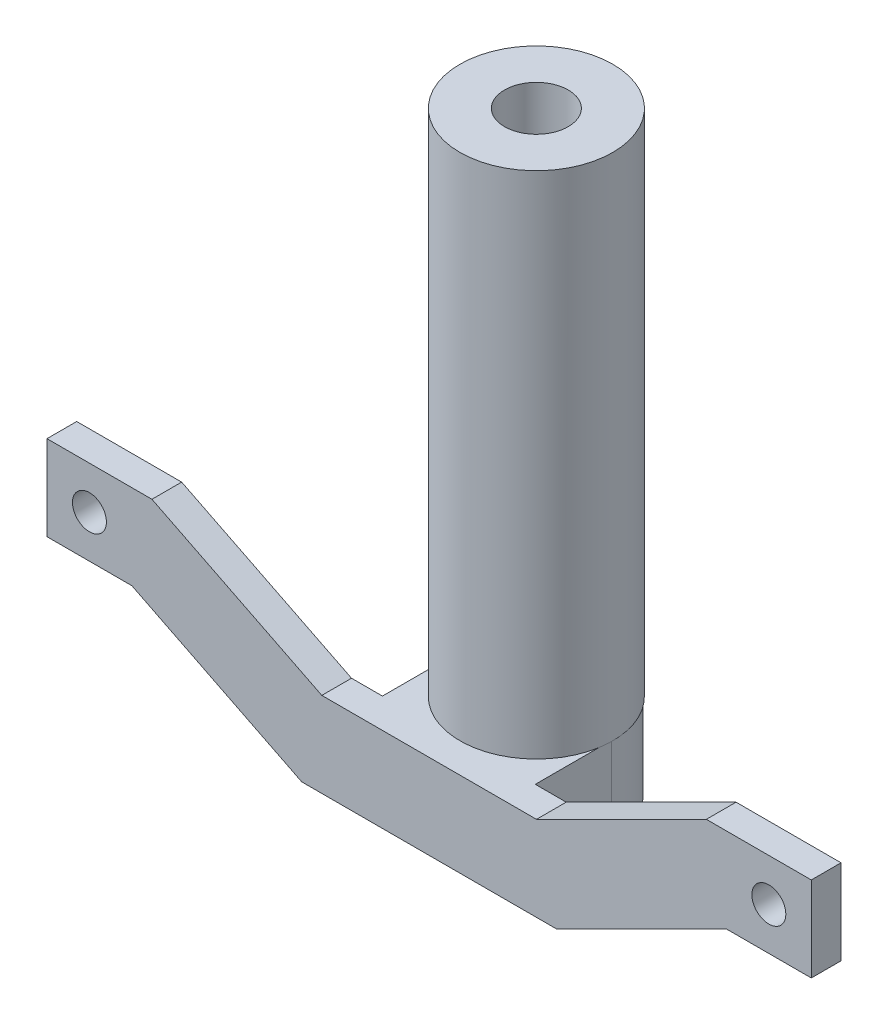
ISO-10303-21;
HEADER;
FILE_DESCRIPTION(('STEP AP214'),'2;1');
FILE_NAME('part.step','',(''),(''),'','','');
FILE_SCHEMA(('AUTOMOTIVE_DESIGN { 1 0 10303 214 1 1 1 1 }'));
ENDSEC;
DATA;
#1=APPLICATION_CONTEXT('core data for automotive mechanical design processes');
#2=APPLICATION_PROTOCOL_DEFINITION('international standard','automotive_design',2000,#1);
#3=PRODUCT_CONTEXT('',#1,'mechanical');
#4=PRODUCT('Part','Part','',(#3));
#5=PRODUCT_RELATED_PRODUCT_CATEGORY('part','',(#4));
#6=PRODUCT_DEFINITION_FORMATION('','',#4);
#7=PRODUCT_DEFINITION_CONTEXT('part definition',#1,'design');
#8=PRODUCT_DEFINITION('design','',#6,#7);
#9=PRODUCT_DEFINITION_SHAPE('','',#8);
#10=(LENGTH_UNIT() NAMED_UNIT(*) SI_UNIT(.MILLI.,.METRE.));
#11=(NAMED_UNIT(*) PLANE_ANGLE_UNIT() SI_UNIT($,.RADIAN.));
#12=(NAMED_UNIT(*) SI_UNIT($,.STERADIAN.) SOLID_ANGLE_UNIT());
#13=UNCERTAINTY_MEASURE_WITH_UNIT(LENGTH_MEASURE(1.E-05),#10,'distance_accuracy_value','');
#14=(GEOMETRIC_REPRESENTATION_CONTEXT(3) GLOBAL_UNCERTAINTY_ASSIGNED_CONTEXT((#13)) GLOBAL_UNIT_ASSIGNED_CONTEXT((#10,
#11,#12)) REPRESENTATION_CONTEXT('',''));
#15=CARTESIAN_POINT('',(0.,0.,0.));
#16=DIRECTION('',(0.,0.,1.));
#17=DIRECTION('',(1.,0.,0.));
#18=AXIS2_PLACEMENT_3D('',#15,#16,#17);
#19=CARTESIAN_POINT('',(25.2786404500042,20.,7.));
#20=DIRECTION('',(0.,-1.,0.));
#21=DIRECTION('',(0.,0.,-1.));
#22=AXIS2_PLACEMENT_3D('',#19,#20,#21);
#23=PLANE('',#22);
#24=CARTESIAN_POINT('',(0.255418615054737,20.,-18.));
#25=DIRECTION('',(0.,1.,0.));
#26=DIRECTION('',(0.,0.,1.));
#27=AXIS2_PLACEMENT_3D('',#24,#25,#26);
#28=CIRCLE('',#27,18.);
#29=CARTESIAN_POINT('',(0.12770930752737,20.,-35.9995469479865));
#30=VERTEX_POINT('',#29);
#31=CARTESIAN_POINT('',(18.,20.,-14.9784389013204));
#32=VERTEX_POINT('',#31);
#33=EDGE_CURVE('E204',#30,#32,#28,.T.);
#34=ORIENTED_EDGE('',*,*,#33,.F.);
#35=CARTESIAN_POINT('',(0.,20.,-18.));
#36=DIRECTION('',(0.,1.,0.));
#37=DIRECTION('',(0.,0.,1.));
#38=AXIS2_PLACEMENT_3D('',#35,#36,#37);
#39=CIRCLE('',#38,18.);
#40=CARTESIAN_POINT('',(-18.,20.,-18.));
#41=VERTEX_POINT('',#40);
#42=EDGE_CURVE('E194',#30,#41,#39,.T.);
#43=ORIENTED_EDGE('',*,*,#42,.T.);
#44=DIRECTION('',(0.,0.,1.));
#45=VECTOR('',#44,1.);
#46=CARTESIAN_POINT('',(-18.,20.,-36.));
#47=LINE('',#46,#45);
#48=CARTESIAN_POINT('',(-18.,20.,0.));
#49=VERTEX_POINT('',#48);
#50=EDGE_CURVE('E234',#41,#49,#47,.T.);
#51=ORIENTED_EDGE('',*,*,#50,.T.);
#52=DIRECTION('',(-1.,0.,0.));
#53=VECTOR('',#52,1.);
#54=CARTESIAN_POINT('',(25.2786404500042,20.,0.));
#55=LINE('',#54,#53);
#56=CARTESIAN_POINT('',(-25.2786404500042,20.,0.));
#57=VERTEX_POINT('',#56);
#58=EDGE_CURVE('E288',#49,#57,#55,.T.);
#59=ORIENTED_EDGE('',*,*,#58,.T.);
#60=DIRECTION('',(0.,0.,-1.));
#61=VECTOR('',#60,1.);
#62=CARTESIAN_POINT('',(-25.2786404500042,20.,7.));
#63=LINE('',#62,#61);
#64=CARTESIAN_POINT('',(-25.2786404500042,20.,7.));
#65=VERTEX_POINT('',#64);
#66=EDGE_CURVE('E321',#65,#57,#63,.T.);
#67=ORIENTED_EDGE('',*,*,#66,.F.);
#68=DIRECTION('',(-1.,0.,0.));
#69=VECTOR('',#68,1.);
#70=CARTESIAN_POINT('',(25.2786404500042,20.,7.));
#71=LINE('',#70,#69);
#72=CARTESIAN_POINT('',(25.2786404500042,20.,7.));
#73=VERTEX_POINT('',#72);
#74=EDGE_CURVE('E263',#73,#65,#71,.T.);
#75=ORIENTED_EDGE('',*,*,#74,.F.);
#76=DIRECTION('',(0.,0.,-1.));
#77=VECTOR('',#76,1.);
#78=CARTESIAN_POINT('',(25.2786404500042,20.,7.));
#79=LINE('',#78,#77);
#80=CARTESIAN_POINT('',(25.2786404500042,20.,0.));
#81=VERTEX_POINT('',#80);
#82=EDGE_CURVE('E324',#73,#81,#79,.T.);
#83=ORIENTED_EDGE('',*,*,#82,.T.);
#84=CARTESIAN_POINT('',(18.,20.,0.));
#85=VERTEX_POINT('',#84);
#86=EDGE_CURVE('E289',#81,#85,#55,.T.);
#87=ORIENTED_EDGE('',*,*,#86,.T.);
#88=DIRECTION('',(0.,0.,1.));
#89=VECTOR('',#88,1.);
#90=CARTESIAN_POINT('',(18.,20.,-36.));
#91=LINE('',#90,#89);
#92=EDGE_CURVE('E91',#32,#85,#91,.T.);
#93=ORIENTED_EDGE('',*,*,#92,.F.);
#94=EDGE_LOOP('',(#34,#43,#51,#59,#67,#75,#83,#87,#93));
#95=FACE_BOUND('',#94,.T.);
#96=ADVANCED_FACE('F75',(#95),#23,.F.);
#97=CARTESIAN_POINT('',(-30.,0.,7.));
#98=DIRECTION('',(0.,1.,0.));
#99=DIRECTION('',(0.,0.,1.));
#100=AXIS2_PLACEMENT_3D('',#97,#98,#99);
#101=PLANE('',#100);
#102=CARTESIAN_POINT('',(0.255418615054737,0.,-18.));
#103=DIRECTION('',(0.,1.,0.));
#104=DIRECTION('',(0.,0.,1.));
#105=AXIS2_PLACEMENT_3D('',#102,#103,#104);
#106=CIRCLE('',#105,7.5);
#107=CARTESIAN_POINT('',(0.255418615054737,0.,-10.5));
#108=VERTEX_POINT('',#107);
#109=EDGE_CURVE('E79',#108,#108,#106,.T.);
#110=ORIENTED_EDGE('',*,*,#109,.T.);
#111=EDGE_LOOP('',(#110));
#112=FACE_BOUND('',#111,.T.);
#113=DIRECTION('',(0.,0.,1.));
#114=VECTOR('',#113,1.);
#115=CARTESIAN_POINT('',(-18.,0.,-36.));
#116=LINE('',#115,#114);
#117=CARTESIAN_POINT('',(-18.,0.,-18.));
#118=VERTEX_POINT('',#117);
#119=CARTESIAN_POINT('',(-18.,0.,0.));
#120=VERTEX_POINT('',#119);
#121=EDGE_CURVE('E236',#118,#120,#116,.T.);
#122=ORIENTED_EDGE('',*,*,#121,.F.);
#123=CARTESIAN_POINT('',(0.,0.,-18.));
#124=DIRECTION('',(0.,1.,0.));
#125=DIRECTION('',(0.,0.,1.));
#126=AXIS2_PLACEMENT_3D('',#123,#124,#125);
#127=CIRCLE('',#126,18.);
#128=CARTESIAN_POINT('',(18.,0.,-18.));
#129=VERTEX_POINT('',#128);
#130=EDGE_CURVE('E224',#129,#118,#127,.T.);
#131=ORIENTED_EDGE('',*,*,#130,.F.);
#132=DIRECTION('',(0.,0.,1.));
#133=VECTOR('',#132,1.);
#134=CARTESIAN_POINT('',(18.,0.,-36.));
#135=LINE('',#134,#133);
#136=CARTESIAN_POINT('',(18.,0.,0.));
#137=VERTEX_POINT('',#136);
#138=EDGE_CURVE('E231',#129,#137,#135,.T.);
#139=ORIENTED_EDGE('',*,*,#138,.T.);
#140=DIRECTION('',(1.,0.,0.));
#141=VECTOR('',#140,1.);
#142=CARTESIAN_POINT('',(-30.,0.,0.));
#143=LINE('',#142,#141);
#144=CARTESIAN_POINT('',(30.,0.,0.));
#145=VERTEX_POINT('',#144);
#146=EDGE_CURVE('E301',#137,#145,#143,.T.);
#147=ORIENTED_EDGE('',*,*,#146,.T.);
#148=DIRECTION('',(0.,0.,-1.));
#149=VECTOR('',#148,1.);
#150=CARTESIAN_POINT('',(30.,0.,7.));
#151=LINE('',#150,#149);
#152=CARTESIAN_POINT('',(30.,0.,7.));
#153=VERTEX_POINT('',#152);
#154=EDGE_CURVE('E277',#153,#145,#151,.T.);
#155=ORIENTED_EDGE('',*,*,#154,.F.);
#156=DIRECTION('',(1.,0.,0.));
#157=VECTOR('',#156,1.);
#158=CARTESIAN_POINT('',(-30.,0.,7.));
#159=LINE('',#158,#157);
#160=CARTESIAN_POINT('',(-30.,0.,7.));
#161=VERTEX_POINT('',#160);
#162=EDGE_CURVE('E275',#161,#153,#159,.T.);
#163=ORIENTED_EDGE('',*,*,#162,.F.);
#164=DIRECTION('',(0.,0.,-1.));
#165=VECTOR('',#164,1.);
#166=CARTESIAN_POINT('',(-30.,0.,7.));
#167=LINE('',#166,#165);
#168=CARTESIAN_POINT('',(-30.,0.,0.));
#169=VERTEX_POINT('',#168);
#170=EDGE_CURVE('E306',#161,#169,#167,.T.);
#171=ORIENTED_EDGE('',*,*,#170,.T.);
#172=EDGE_CURVE('E255',#169,#120,#143,.T.);
#173=ORIENTED_EDGE('',*,*,#172,.T.);
#174=EDGE_LOOP('',(#122,#131,#139,#147,#155,#163,#171,#173));
#175=FACE_BOUND('',#174,.T.);
#176=ADVANCED_FACE('F371',(#112,#175),#101,.F.);
#177=CARTESIAN_POINT('',(-18.,0.,-36.));
#178=DIRECTION('',(1.,0.,0.));
#179=DIRECTION('',(0.,1.,0.));
#180=AXIS2_PLACEMENT_3D('',#177,#178,#179);
#181=PLANE('',#180);
#182=DIRECTION('',(0.,1.,0.));
#183=VECTOR('',#182,1.);
#184=CARTESIAN_POINT('',(-18.,-16.,-18.));
#185=LINE('',#184,#183);
#186=EDGE_CURVE('E200',#118,#41,#185,.T.);
#187=ORIENTED_EDGE('',*,*,#186,.F.);
#188=ORIENTED_EDGE('',*,*,#121,.T.);
#189=DIRECTION('',(0.,1.,0.));
#190=VECTOR('',#189,1.);
#191=CARTESIAN_POINT('',(-18.,0.,0.));
#192=LINE('',#191,#190);
#193=EDGE_CURVE('E226',#120,#49,#192,.T.);
#194=ORIENTED_EDGE('',*,*,#193,.T.);
#195=ORIENTED_EDGE('',*,*,#50,.F.);
#196=EDGE_LOOP('',(#187,#188,#194,#195));
#197=FACE_BOUND('',#196,.T.);
#198=ADVANCED_FACE('F373',(#197),#181,.F.);
#199=CARTESIAN_POINT('',(0.,0.,0.));
#200=DIRECTION('',(0.,0.,1.));
#201=DIRECTION('',(1.,0.,0.));
#202=AXIS2_PLACEMENT_3D('',#199,#200,#201);
#203=PLANE('',#202);
#204=CARTESIAN_POINT('',(80.,30.,0.));
#205=DIRECTION('',(0.,0.,1.));
#206=DIRECTION('',(1.,0.,0.));
#207=AXIS2_PLACEMENT_3D('',#204,#205,#206);
#208=CIRCLE('',#207,4.00000000000001);
#209=CARTESIAN_POINT('',(84.,30.,0.));
#210=VERTEX_POINT('',#209);
#211=EDGE_CURVE('E242',#210,#210,#208,.T.);
#212=ORIENTED_EDGE('',*,*,#211,.T.);
#213=EDGE_LOOP('',(#212));
#214=FACE_BOUND('',#213,.T.);
#215=DIRECTION('',(0.,-1.,0.));
#216=VECTOR('',#215,1.);
#217=CARTESIAN_POINT('',(18.,0.,0.));
#218=LINE('',#217,#216);
#219=EDGE_CURVE('E229',#85,#137,#218,.T.);
#220=ORIENTED_EDGE('',*,*,#219,.F.);
#221=ORIENTED_EDGE('',*,*,#86,.F.);
#222=DIRECTION('',(-0.894427190999916,-0.447213595499958,0.));
#223=VECTOR('',#222,1.);
#224=CARTESIAN_POINT('',(65.2786404500042,40.,0.));
#225=LINE('',#224,#223);
#226=CARTESIAN_POINT('',(65.2786404500042,40.,0.));
#227=VERTEX_POINT('',#226);
#228=EDGE_CURVE('E286',#227,#81,#225,.T.);
#229=ORIENTED_EDGE('',*,*,#228,.F.);
#230=DIRECTION('',(-1.,0.,0.));
#231=VECTOR('',#230,1.);
#232=CARTESIAN_POINT('',(90.,40.,0.));
#233=LINE('',#232,#231);
#234=CARTESIAN_POINT('',(90.,40.,0.));
#235=VERTEX_POINT('',#234);
#236=EDGE_CURVE('E284',#235,#227,#233,.T.);
#237=ORIENTED_EDGE('',*,*,#236,.F.);
#238=DIRECTION('',(0.,1.,0.));
#239=VECTOR('',#238,1.);
#240=CARTESIAN_POINT('',(90.,20.,0.));
#241=LINE('',#240,#239);
#242=CARTESIAN_POINT('',(90.,20.,0.));
#243=VERTEX_POINT('',#242);
#244=EDGE_CURVE('E282',#243,#235,#241,.T.);
#245=ORIENTED_EDGE('',*,*,#244,.F.);
#246=DIRECTION('',(1.,0.,0.));
#247=VECTOR('',#246,1.);
#248=CARTESIAN_POINT('',(70.,20.,0.));
#249=LINE('',#248,#247);
#250=CARTESIAN_POINT('',(70.,20.,0.));
#251=VERTEX_POINT('',#250);
#252=EDGE_CURVE('E280',#251,#243,#249,.T.);
#253=ORIENTED_EDGE('',*,*,#252,.F.);
#254=DIRECTION('',(0.894427190999916,0.447213595499958,0.));
#255=VECTOR('',#254,1.);
#256=CARTESIAN_POINT('',(30.,0.,0.));
#257=LINE('',#256,#255);
#258=EDGE_CURVE('E248',#145,#251,#257,.T.);
#259=ORIENTED_EDGE('',*,*,#258,.F.);
#260=ORIENTED_EDGE('',*,*,#146,.F.);
#261=EDGE_LOOP('',(#220,#221,#229,#237,#245,#253,#259,#260));
#262=FACE_BOUND('',#261,.T.);
#263=ADVANCED_FACE('F343',(#214,#262),#203,.F.);
#264=CARTESIAN_POINT('',(-80.,30.,0.));
#265=DIRECTION('',(0.,0.,1.));
#266=DIRECTION('',(-1.,0.,0.));
#267=AXIS2_PLACEMENT_3D('',#264,#265,#266);
#268=CIRCLE('',#267,4.00000000000001);
#269=CARTESIAN_POINT('',(-84.,30.,0.));
#270=VERTEX_POINT('',#269);
#271=EDGE_CURVE('E238',#270,#270,#268,.T.);
#272=ORIENTED_EDGE('',*,*,#271,.T.);
#273=EDGE_LOOP('',(#272));
#274=FACE_BOUND('',#273,.T.);
#275=ORIENTED_EDGE('',*,*,#193,.F.);
#276=ORIENTED_EDGE('',*,*,#172,.F.);
#277=DIRECTION('',(0.894427190999916,-0.447213595499958,0.));
#278=VECTOR('',#277,1.);
#279=CARTESIAN_POINT('',(-30.,0.,0.));
#280=LINE('',#279,#278);
#281=CARTESIAN_POINT('',(-70.,20.,0.));
#282=VERTEX_POINT('',#281);
#283=EDGE_CURVE('E299',#282,#169,#280,.T.);
#284=ORIENTED_EDGE('',*,*,#283,.F.);
#285=DIRECTION('',(1.,0.,0.));
#286=VECTOR('',#285,1.);
#287=CARTESIAN_POINT('',(-70.,20.,0.));
#288=LINE('',#287,#286);
#289=CARTESIAN_POINT('',(-90.,20.,0.));
#290=VERTEX_POINT('',#289);
#291=EDGE_CURVE('E297',#290,#282,#288,.T.);
#292=ORIENTED_EDGE('',*,*,#291,.F.);
#293=DIRECTION('',(0.,-1.,0.));
#294=VECTOR('',#293,1.);
#295=CARTESIAN_POINT('',(-90.,20.,0.));
#296=LINE('',#295,#294);
#297=CARTESIAN_POINT('',(-90.,40.,0.));
#298=VERTEX_POINT('',#297);
#299=EDGE_CURVE('E295',#298,#290,#296,.T.);
#300=ORIENTED_EDGE('',*,*,#299,.F.);
#301=DIRECTION('',(-1.,0.,0.));
#302=VECTOR('',#301,1.);
#303=CARTESIAN_POINT('',(-90.,40.,0.));
#304=LINE('',#303,#302);
#305=CARTESIAN_POINT('',(-65.2786404500042,40.,0.));
#306=VERTEX_POINT('',#305);
#307=EDGE_CURVE('E293',#306,#298,#304,.T.);
#308=ORIENTED_EDGE('',*,*,#307,.F.);
#309=DIRECTION('',(-0.894427190999916,0.447213595499958,0.));
#310=VECTOR('',#309,1.);
#311=CARTESIAN_POINT('',(-65.2786404500042,40.,0.));
#312=LINE('',#311,#310);
#313=EDGE_CURVE('E291',#57,#306,#312,.T.);
#314=ORIENTED_EDGE('',*,*,#313,.F.);
#315=ORIENTED_EDGE('',*,*,#58,.F.);
#316=EDGE_LOOP('',(#275,#276,#284,#292,#300,#308,#314,#315));
#317=FACE_BOUND('',#316,.T.);
#318=ADVANCED_FACE('F378',(#274,#317),#203,.F.);
#319=CARTESIAN_POINT('',(0.,0.,7.));
#320=DIRECTION('',(0.,0.,1.));
#321=DIRECTION('',(1.,0.,0.));
#322=AXIS2_PLACEMENT_3D('',#319,#320,#321);
#323=PLANE('',#322);
#324=CARTESIAN_POINT('',(80.,30.,7.));
#325=DIRECTION('',(0.,0.,1.));
#326=DIRECTION('',(1.,0.,0.));
#327=AXIS2_PLACEMENT_3D('',#324,#325,#326);
#328=CIRCLE('',#327,4.00000000000001);
#329=CARTESIAN_POINT('',(84.,30.,7.));
#330=VERTEX_POINT('',#329);
#331=EDGE_CURVE('E245',#330,#330,#328,.T.);
#332=ORIENTED_EDGE('',*,*,#331,.F.);
#333=EDGE_LOOP('',(#332));
#334=FACE_BOUND('',#333,.T.);
#335=DIRECTION('',(0.894427190999916,0.447213595499958,0.));
#336=VECTOR('',#335,1.);
#337=CARTESIAN_POINT('',(30.,0.,7.));
#338=LINE('',#337,#336);
#339=CARTESIAN_POINT('',(70.,20.,7.));
#340=VERTEX_POINT('',#339);
#341=EDGE_CURVE('E251',#153,#340,#338,.T.);
#342=ORIENTED_EDGE('',*,*,#341,.T.);
#343=DIRECTION('',(1.,0.,0.));
#344=VECTOR('',#343,1.);
#345=CARTESIAN_POINT('',(70.,20.,7.));
#346=LINE('',#345,#344);
#347=CARTESIAN_POINT('',(90.,20.,7.));
#348=VERTEX_POINT('',#347);
#349=EDGE_CURVE('E254',#340,#348,#346,.T.);
#350=ORIENTED_EDGE('',*,*,#349,.T.);
#351=DIRECTION('',(0.,1.,0.));
#352=VECTOR('',#351,1.);
#353=CARTESIAN_POINT('',(90.,20.,7.));
#354=LINE('',#353,#352);
#355=CARTESIAN_POINT('',(90.,40.,7.));
#356=VERTEX_POINT('',#355);
#357=EDGE_CURVE('E257',#348,#356,#354,.T.);
#358=ORIENTED_EDGE('',*,*,#357,.T.);
#359=DIRECTION('',(-1.,0.,0.));
#360=VECTOR('',#359,1.);
#361=CARTESIAN_POINT('',(90.,40.,7.));
#362=LINE('',#361,#360);
#363=CARTESIAN_POINT('',(65.2786404500042,40.,7.));
#364=VERTEX_POINT('',#363);
#365=EDGE_CURVE('E259',#356,#364,#362,.T.);
#366=ORIENTED_EDGE('',*,*,#365,.T.);
#367=DIRECTION('',(-0.894427190999916,-0.447213595499958,0.));
#368=VECTOR('',#367,1.);
#369=CARTESIAN_POINT('',(65.2786404500042,40.,7.));
#370=LINE('',#369,#368);
#371=EDGE_CURVE('E261',#364,#73,#370,.T.);
#372=ORIENTED_EDGE('',*,*,#371,.T.);
#373=ORIENTED_EDGE('',*,*,#74,.T.);
#374=DIRECTION('',(-0.894427190999916,0.447213595499958,0.));
#375=VECTOR('',#374,1.);
#376=CARTESIAN_POINT('',(-65.2786404500042,40.,7.));
#377=LINE('',#376,#375);
#378=CARTESIAN_POINT('',(-65.2786404500042,40.,7.));
#379=VERTEX_POINT('',#378);
#380=EDGE_CURVE('E265',#65,#379,#377,.T.);
#381=ORIENTED_EDGE('',*,*,#380,.T.);
#382=DIRECTION('',(-1.,0.,0.));
#383=VECTOR('',#382,1.);
#384=CARTESIAN_POINT('',(-90.,40.,7.));
#385=LINE('',#384,#383);
#386=CARTESIAN_POINT('',(-90.,40.,7.));
#387=VERTEX_POINT('',#386);
#388=EDGE_CURVE('E267',#379,#387,#385,.T.);
#389=ORIENTED_EDGE('',*,*,#388,.T.);
#390=DIRECTION('',(0.,-1.,0.));
#391=VECTOR('',#390,1.);
#392=CARTESIAN_POINT('',(-90.,20.,7.));
#393=LINE('',#392,#391);
#394=CARTESIAN_POINT('',(-90.,20.,7.));
#395=VERTEX_POINT('',#394);
#396=EDGE_CURVE('E269',#387,#395,#393,.T.);
#397=ORIENTED_EDGE('',*,*,#396,.T.);
#398=DIRECTION('',(1.,0.,0.));
#399=VECTOR('',#398,1.);
#400=CARTESIAN_POINT('',(-70.,20.,7.));
#401=LINE('',#400,#399);
#402=CARTESIAN_POINT('',(-70.,20.,7.));
#403=VERTEX_POINT('',#402);
#404=EDGE_CURVE('E271',#395,#403,#401,.T.);
#405=ORIENTED_EDGE('',*,*,#404,.T.);
#406=DIRECTION('',(0.894427190999916,-0.447213595499958,0.));
#407=VECTOR('',#406,1.);
#408=CARTESIAN_POINT('',(-30.,0.,7.));
#409=LINE('',#408,#407);
#410=EDGE_CURVE('E273',#403,#161,#409,.T.);
#411=ORIENTED_EDGE('',*,*,#410,.T.);
#412=ORIENTED_EDGE('',*,*,#162,.T.);
#413=EDGE_LOOP('',(#342,#350,#358,#366,#372,#373,#381,#389,#397,#405,#411,#412));
#414=FACE_BOUND('',#413,.T.);
#415=CARTESIAN_POINT('',(-80.,30.,7.));
#416=DIRECTION('',(0.,0.,1.));
#417=DIRECTION('',(-1.,0.,0.));
#418=AXIS2_PLACEMENT_3D('',#415,#416,#417);
#419=CIRCLE('',#418,4.00000000000001);
#420=CARTESIAN_POINT('',(-84.,30.,7.));
#421=VERTEX_POINT('',#420);
#422=EDGE_CURVE('E239',#421,#421,#419,.T.);
#423=ORIENTED_EDGE('',*,*,#422,.F.);
#424=EDGE_LOOP('',(#423));
#425=FACE_BOUND('',#424,.T.);
#426=ADVANCED_FACE('F357',(#334,#414,#425),#323,.T.);
#427=CARTESIAN_POINT('',(30.,0.,7.));
#428=DIRECTION('',(-0.447213595499958,0.894427190999916,0.));
#429=DIRECTION('',(-0.894427190999916,-0.447213595499958,0.));
#430=AXIS2_PLACEMENT_3D('',#427,#428,#429);
#431=PLANE('',#430);
#432=ORIENTED_EDGE('',*,*,#258,.T.);
#433=DIRECTION('',(0.,0.,-1.));
#434=VECTOR('',#433,1.);
#435=CARTESIAN_POINT('',(70.,20.,7.));
#436=LINE('',#435,#434);
#437=EDGE_CURVE('E12',#340,#251,#436,.T.);
#438=ORIENTED_EDGE('',*,*,#437,.F.);
#439=ORIENTED_EDGE('',*,*,#341,.F.);
#440=ORIENTED_EDGE('',*,*,#154,.T.);
#441=EDGE_LOOP('',(#432,#438,#439,#440));
#442=FACE_BOUND('',#441,.T.);
#443=ADVANCED_FACE('F77',(#442),#431,.F.);
#444=CARTESIAN_POINT('',(70.,20.,7.));
#445=DIRECTION('',(0.,1.,0.));
#446=DIRECTION('',(0.,0.,1.));
#447=AXIS2_PLACEMENT_3D('',#444,#445,#446);
#448=PLANE('',#447);
#449=ORIENTED_EDGE('',*,*,#252,.T.);
#450=DIRECTION('',(0.,0.,-1.));
#451=VECTOR('',#450,1.);
#452=CARTESIAN_POINT('',(90.,20.,7.));
#453=LINE('',#452,#451);
#454=EDGE_CURVE('E84',#348,#243,#453,.T.);
#455=ORIENTED_EDGE('',*,*,#454,.F.);
#456=ORIENTED_EDGE('',*,*,#349,.F.);
#457=ORIENTED_EDGE('',*,*,#437,.T.);
#458=EDGE_LOOP('',(#449,#455,#456,#457));
#459=FACE_BOUND('',#458,.T.);
#460=ADVANCED_FACE('F362',(#459),#448,.F.);
#461=CARTESIAN_POINT('',(90.,20.,7.));
#462=DIRECTION('',(-1.,0.,0.));
#463=DIRECTION('',(0.,0.,1.));
#464=AXIS2_PLACEMENT_3D('',#461,#462,#463);
#465=PLANE('',#464);
#466=ORIENTED_EDGE('',*,*,#244,.T.);
#467=DIRECTION('',(0.,0.,-1.));
#468=VECTOR('',#467,1.);
#469=CARTESIAN_POINT('',(90.,40.,7.));
#470=LINE('',#469,#468);
#471=EDGE_CURVE('E330',#356,#235,#470,.T.);
#472=ORIENTED_EDGE('',*,*,#471,.F.);
#473=ORIENTED_EDGE('',*,*,#357,.F.);
#474=ORIENTED_EDGE('',*,*,#454,.T.);
#475=EDGE_LOOP('',(#466,#472,#473,#474));
#476=FACE_BOUND('',#475,.T.);
#477=ADVANCED_FACE('F338',(#476),#465,.F.);
#478=CARTESIAN_POINT('',(90.,40.,7.));
#479=DIRECTION('',(0.,-1.,0.));
#480=DIRECTION('',(0.,0.,-1.));
#481=AXIS2_PLACEMENT_3D('',#478,#479,#480);
#482=PLANE('',#481);
#483=ORIENTED_EDGE('',*,*,#236,.T.);
#484=DIRECTION('',(0.,0.,-1.));
#485=VECTOR('',#484,1.);
#486=CARTESIAN_POINT('',(65.2786404500042,40.,7.));
#487=LINE('',#486,#485);
#488=EDGE_CURVE('E327',#364,#227,#487,.T.);
#489=ORIENTED_EDGE('',*,*,#488,.F.);
#490=ORIENTED_EDGE('',*,*,#365,.F.);
#491=ORIENTED_EDGE('',*,*,#471,.T.);
#492=EDGE_LOOP('',(#483,#489,#490,#491));
#493=FACE_BOUND('',#492,.T.);
#494=ADVANCED_FACE('F349',(#493),#482,.F.);
#495=CARTESIAN_POINT('',(65.2786404500042,40.,7.));
#496=DIRECTION('',(0.447213595499958,-0.894427190999916,0.));
#497=DIRECTION('',(0.894427190999916,0.447213595499958,0.));
#498=AXIS2_PLACEMENT_3D('',#495,#496,#497);
#499=PLANE('',#498);
#500=ORIENTED_EDGE('',*,*,#228,.T.);
#501=ORIENTED_EDGE('',*,*,#82,.F.);
#502=ORIENTED_EDGE('',*,*,#371,.F.);
#503=ORIENTED_EDGE('',*,*,#488,.T.);
#504=EDGE_LOOP('',(#500,#501,#502,#503));
#505=FACE_BOUND('',#504,.T.);
#506=ADVANCED_FACE('F353',(#505),#499,.F.);
#507=CARTESIAN_POINT('',(-65.2786404500042,40.,7.));
#508=DIRECTION('',(-0.447213595499958,-0.894427190999916,0.));
#509=DIRECTION('',(0.894427190999916,-0.447213595499958,0.));
#510=AXIS2_PLACEMENT_3D('',#507,#508,#509);
#511=PLANE('',#510);
#512=ORIENTED_EDGE('',*,*,#313,.T.);
#513=DIRECTION('',(0.,0.,-1.));
#514=VECTOR('',#513,1.);
#515=CARTESIAN_POINT('',(-65.2786404500042,40.,7.));
#516=LINE('',#515,#514);
#517=EDGE_CURVE('E318',#379,#306,#516,.T.);
#518=ORIENTED_EDGE('',*,*,#517,.F.);
#519=ORIENTED_EDGE('',*,*,#380,.F.);
#520=ORIENTED_EDGE('',*,*,#66,.T.);
#521=EDGE_LOOP('',(#512,#518,#519,#520));
#522=FACE_BOUND('',#521,.T.);
#523=ADVANCED_FACE('F384',(#522),#511,.F.);
#524=CARTESIAN_POINT('',(-90.,40.,7.));
#525=DIRECTION('',(0.,-1.,0.));
#526=DIRECTION('',(0.,0.,-1.));
#527=AXIS2_PLACEMENT_3D('',#524,#525,#526);
#528=PLANE('',#527);
#529=ORIENTED_EDGE('',*,*,#307,.T.);
#530=DIRECTION('',(0.,0.,-1.));
#531=VECTOR('',#530,1.);
#532=CARTESIAN_POINT('',(-90.,40.,7.));
#533=LINE('',#532,#531);
#534=EDGE_CURVE('E315',#387,#298,#533,.T.);
#535=ORIENTED_EDGE('',*,*,#534,.F.);
#536=ORIENTED_EDGE('',*,*,#388,.F.);
#537=ORIENTED_EDGE('',*,*,#517,.T.);
#538=EDGE_LOOP('',(#529,#535,#536,#537));
#539=FACE_BOUND('',#538,.T.);
#540=ADVANCED_FACE('F388',(#539),#528,.F.);
#541=CARTESIAN_POINT('',(-90.,20.,7.));
#542=DIRECTION('',(1.,0.,0.));
#543=DIRECTION('',(0.,0.,-1.));
#544=AXIS2_PLACEMENT_3D('',#541,#542,#543);
#545=PLANE('',#544);
#546=ORIENTED_EDGE('',*,*,#299,.T.);
#547=DIRECTION('',(0.,0.,-1.));
#548=VECTOR('',#547,1.);
#549=CARTESIAN_POINT('',(-90.,20.,7.));
#550=LINE('',#549,#548);
#551=EDGE_CURVE('E312',#395,#290,#550,.T.);
#552=ORIENTED_EDGE('',*,*,#551,.F.);
#553=ORIENTED_EDGE('',*,*,#396,.F.);
#554=ORIENTED_EDGE('',*,*,#534,.T.);
#555=EDGE_LOOP('',(#546,#552,#553,#554));
#556=FACE_BOUND('',#555,.T.);
#557=ADVANCED_FACE('F395',(#556),#545,.F.);
#558=CARTESIAN_POINT('',(-70.,20.,7.));
#559=DIRECTION('',(0.,1.,0.));
#560=DIRECTION('',(0.,0.,1.));
#561=AXIS2_PLACEMENT_3D('',#558,#559,#560);
#562=PLANE('',#561);
#563=ORIENTED_EDGE('',*,*,#291,.T.);
#564=DIRECTION('',(0.,0.,-1.));
#565=VECTOR('',#564,1.);
#566=CARTESIAN_POINT('',(-70.,20.,7.));
#567=LINE('',#566,#565);
#568=EDGE_CURVE('E309',#403,#282,#567,.T.);
#569=ORIENTED_EDGE('',*,*,#568,.F.);
#570=ORIENTED_EDGE('',*,*,#404,.F.);
#571=ORIENTED_EDGE('',*,*,#551,.T.);
#572=EDGE_LOOP('',(#563,#569,#570,#571));
#573=FACE_BOUND('',#572,.T.);
#574=ADVANCED_FACE('F398',(#573),#562,.F.);
#575=CARTESIAN_POINT('',(-30.,0.,7.));
#576=DIRECTION('',(0.447213595499958,0.894427190999916,0.));
#577=DIRECTION('',(-0.894427190999916,0.447213595499958,0.));
#578=AXIS2_PLACEMENT_3D('',#575,#576,#577);
#579=PLANE('',#578);
#580=ORIENTED_EDGE('',*,*,#283,.T.);
#581=ORIENTED_EDGE('',*,*,#170,.F.);
#582=ORIENTED_EDGE('',*,*,#410,.F.);
#583=ORIENTED_EDGE('',*,*,#568,.T.);
#584=EDGE_LOOP('',(#580,#581,#582,#583));
#585=FACE_BOUND('',#584,.T.);
#586=ADVANCED_FACE('F403',(#585),#579,.F.);
#587=CARTESIAN_POINT('',(80.,30.,7.));
#588=DIRECTION('',(0.,0.,-1.));
#589=DIRECTION('',(-1.,0.,0.));
#590=AXIS2_PLACEMENT_3D('',#587,#588,#589);
#591=CYLINDRICAL_SURFACE('',#590,4.00000000000001);
#592=ORIENTED_EDGE('',*,*,#331,.T.);
#593=EDGE_LOOP('',(#592));
#594=FACE_BOUND('',#593,.T.);
#595=ORIENTED_EDGE('',*,*,#211,.F.);
#596=EDGE_LOOP('',(#595));
#597=FACE_BOUND('',#596,.T.);
#598=ADVANCED_FACE('F406',(#594,#597),#591,.F.);
#599=CARTESIAN_POINT('',(-80.,30.,7.));
#600=DIRECTION('',(0.,0.,-1.));
#601=DIRECTION('',(-1.,0.,0.));
#602=AXIS2_PLACEMENT_3D('',#599,#600,#601);
#603=CYLINDRICAL_SURFACE('',#602,4.00000000000001);
#604=ORIENTED_EDGE('',*,*,#422,.T.);
#605=EDGE_LOOP('',(#604));
#606=FACE_BOUND('',#605,.T.);
#607=ORIENTED_EDGE('',*,*,#271,.F.);
#608=EDGE_LOOP('',(#607));
#609=FACE_BOUND('',#608,.T.);
#610=ADVANCED_FACE('F412',(#606,#609),#603,.F.);
#611=CARTESIAN_POINT('',(18.,0.,-36.));
#612=DIRECTION('',(-1.,0.,0.));
#613=DIRECTION('',(0.,-1.,0.));
#614=AXIS2_PLACEMENT_3D('',#611,#612,#613);
#615=PLANE('',#614);
#616=ORIENTED_EDGE('',*,*,#138,.F.);
#617=DIRECTION('',(0.,1.,0.));
#618=VECTOR('',#617,1.);
#619=CARTESIAN_POINT('',(18.,-16.,-18.));
#620=LINE('',#619,#618);
#621=CARTESIAN_POINT('',(18.,20.,-18.));
#622=VERTEX_POINT('',#621);
#623=EDGE_CURVE('E215',#129,#622,#620,.T.);
#624=ORIENTED_EDGE('',*,*,#623,.T.);
#625=EDGE_CURVE('E214',#622,#32,#91,.T.);
#626=ORIENTED_EDGE('',*,*,#625,.T.);
#627=ORIENTED_EDGE('',*,*,#92,.T.);
#628=ORIENTED_EDGE('',*,*,#219,.T.);
#629=EDGE_LOOP('',(#616,#624,#626,#627,#628));
#630=FACE_BOUND('',#629,.T.);
#631=ADVANCED_FACE('F368',(#630),#615,.F.);
#632=CARTESIAN_POINT('',(0.,-16.,-18.));
#633=DIRECTION('',(0.,1.,0.));
#634=DIRECTION('',(0.,0.,1.));
#635=AXIS2_PLACEMENT_3D('',#632,#633,#634);
#636=CYLINDRICAL_SURFACE('',#635,18.);
#637=ORIENTED_EDGE('',*,*,#130,.T.);
#638=ORIENTED_EDGE('',*,*,#186,.T.);
#639=ORIENTED_EDGE('',*,*,#42,.F.);
#640=EDGE_CURVE('E197',#622,#30,#39,.T.);
#641=ORIENTED_EDGE('',*,*,#640,.F.);
#642=ORIENTED_EDGE('',*,*,#623,.F.);
#643=EDGE_LOOP('',(#637,#638,#639,#641,#642));
#644=FACE_BOUND('',#643,.T.);
#645=ADVANCED_FACE('F195',(#644),#636,.T.);
#646=CARTESIAN_POINT('',(0.255418615054737,-16.,-18.));
#647=DIRECTION('',(0.,1.,0.));
#648=DIRECTION('',(0.,0.,1.));
#649=AXIS2_PLACEMENT_3D('',#646,#647,#648);
#650=CYLINDRICAL_SURFACE('',#649,7.5);
#651=ORIENTED_EDGE('',*,*,#109,.F.);
#652=EDGE_LOOP('',(#651));
#653=FACE_BOUND('',#652,.T.);
#654=CARTESIAN_POINT('',(0.255418615054737,140.,-18.));
#655=DIRECTION('',(0.,1.,0.));
#656=DIRECTION('',(0.,0.,1.));
#657=AXIS2_PLACEMENT_3D('',#654,#655,#656);
#658=CIRCLE('',#657,7.5);
#659=CARTESIAN_POINT('',(0.255418615054737,140.,-10.5));
#660=VERTEX_POINT('',#659);
#661=EDGE_CURVE('E209',#660,#660,#658,.T.);
#662=ORIENTED_EDGE('',*,*,#661,.T.);
#663=EDGE_LOOP('',(#662));
#664=FACE_BOUND('',#663,.T.);
#665=ADVANCED_FACE('F470',(#653,#664),#650,.F.);
#666=CARTESIAN_POINT('',(0.255418615054737,20.,-18.));
#667=DIRECTION('',(0.,1.,0.));
#668=DIRECTION('',(0.,0.,1.));
#669=AXIS2_PLACEMENT_3D('',#666,#667,#668);
#670=PLANE('',#669);
#671=EDGE_CURVE('E208',#32,#30,#28,.T.);
#672=ORIENTED_EDGE('',*,*,#671,.F.);
#673=ORIENTED_EDGE('',*,*,#625,.F.);
#674=ORIENTED_EDGE('',*,*,#640,.T.);
#675=EDGE_LOOP('',(#672,#673,#674));
#676=FACE_BOUND('',#675,.T.);
#677=ADVANCED_FACE('F213',(#676),#670,.F.);
#678=CARTESIAN_POINT('',(0.255418615054737,140.,-18.));
#679=DIRECTION('',(0.,1.,0.));
#680=DIRECTION('',(0.,0.,1.));
#681=AXIS2_PLACEMENT_3D('',#678,#679,#680);
#682=PLANE('',#681);
#683=CARTESIAN_POINT('',(0.255418615054737,140.,-18.));
#684=DIRECTION('',(0.,1.,0.));
#685=DIRECTION('',(0.,0.,1.));
#686=AXIS2_PLACEMENT_3D('',#683,#684,#685);
#687=CIRCLE('',#686,18.);
#688=CARTESIAN_POINT('',(0.255418615054737,140.,0.));
#689=VERTEX_POINT('',#688);
#690=EDGE_CURVE('E217',#689,#689,#687,.T.);
#691=ORIENTED_EDGE('',*,*,#690,.T.);
#692=EDGE_LOOP('',(#691));
#693=FACE_BOUND('',#692,.T.);
#694=ORIENTED_EDGE('',*,*,#661,.F.);
#695=EDGE_LOOP('',(#694));
#696=FACE_BOUND('',#695,.T.);
#697=ADVANCED_FACE('F479',(#693,#696),#682,.T.);
#698=CARTESIAN_POINT('',(0.255418615054737,140.,-18.));
#699=DIRECTION('',(0.,-1.,0.));
#700=DIRECTION('',(0.,0.,-1.));
#701=AXIS2_PLACEMENT_3D('',#698,#699,#700);
#702=CYLINDRICAL_SURFACE('',#701,18.);
#703=ORIENTED_EDGE('',*,*,#690,.F.);
#704=EDGE_LOOP('',(#703));
#705=FACE_BOUND('',#704,.T.);
#706=ORIENTED_EDGE('',*,*,#671,.T.);
#707=ORIENTED_EDGE('',*,*,#33,.T.);
#708=EDGE_LOOP('',(#706,#707));
#709=FACE_BOUND('',#708,.T.);
#710=ADVANCED_FACE('F216',(#705,#709),#702,.T.);
#711=CLOSED_SHELL('',(#96,#176,#198,#263,#318,#426,#443,#460,#477,#494,#506,#523,#540,#557,#574,
#586,#598,#610,#631,#645,#665,#677,#697,#710));
#712=MANIFOLD_SOLID_BREP('B2',#711);
#713=ADVANCED_BREP_SHAPE_REPRESENTATION('',(#18,#712),#14);
#714=SHAPE_DEFINITION_REPRESENTATION(#9,#713);
ENDSEC;
END-ISO-10303-21;
